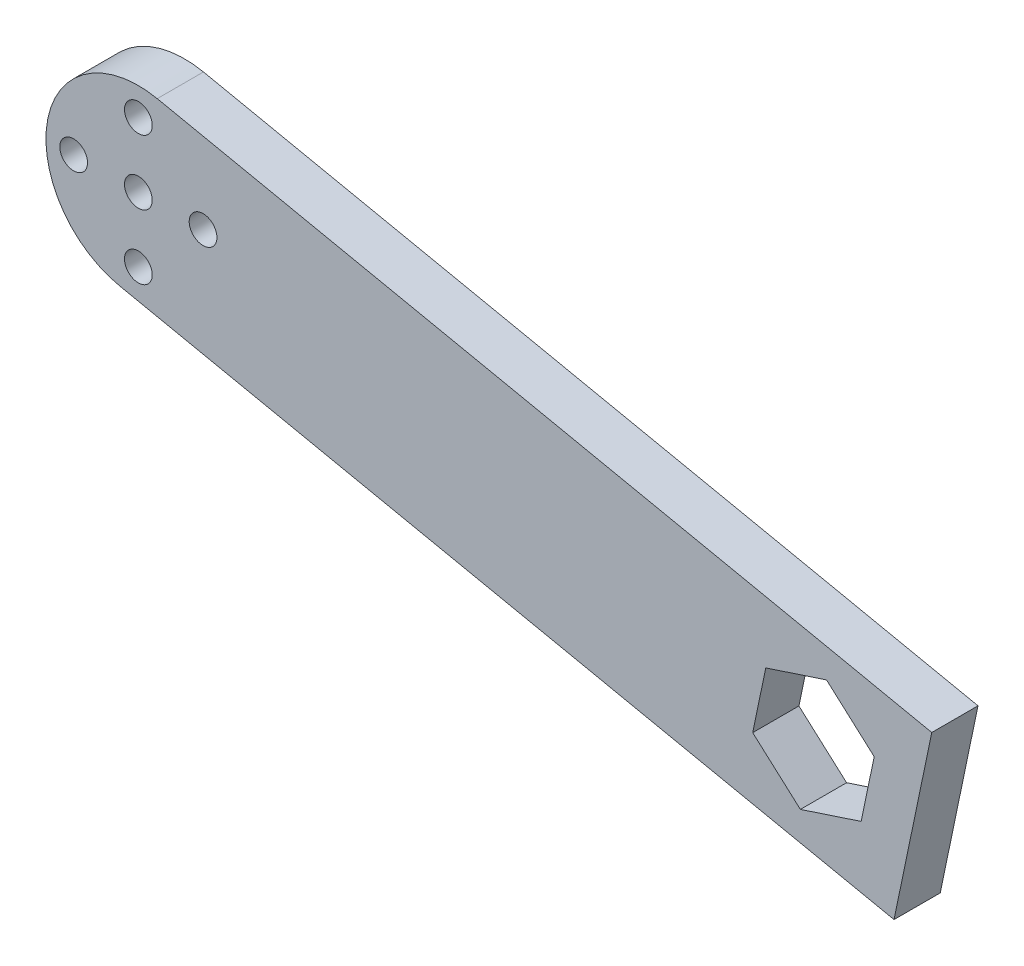
ISO-10303-21;
HEADER;
FILE_DESCRIPTION(('STEP AP214'),'2;1');
FILE_NAME('part.step','',(''),(''),'','','');
FILE_SCHEMA(('AUTOMOTIVE_DESIGN { 1 0 10303 214 1 1 1 1 }'));
ENDSEC;
DATA;
#1=APPLICATION_CONTEXT('core data for automotive mechanical design processes');
#2=APPLICATION_PROTOCOL_DEFINITION('international standard','automotive_design',2000,#1);
#3=PRODUCT_CONTEXT('',#1,'mechanical');
#4=PRODUCT('Part','Part','',(#3));
#5=PRODUCT_RELATED_PRODUCT_CATEGORY('part','',(#4));
#6=PRODUCT_DEFINITION_FORMATION('','',#4);
#7=PRODUCT_DEFINITION_CONTEXT('part definition',#1,'design');
#8=PRODUCT_DEFINITION('design','',#6,#7);
#9=PRODUCT_DEFINITION_SHAPE('','',#8);
#10=(LENGTH_UNIT() NAMED_UNIT(*) SI_UNIT(.MILLI.,.METRE.));
#11=(NAMED_UNIT(*) PLANE_ANGLE_UNIT() SI_UNIT($,.RADIAN.));
#12=(NAMED_UNIT(*) SI_UNIT($,.STERADIAN.) SOLID_ANGLE_UNIT());
#13=UNCERTAINTY_MEASURE_WITH_UNIT(LENGTH_MEASURE(1.E-05),#10,'distance_accuracy_value','');
#14=(GEOMETRIC_REPRESENTATION_CONTEXT(3) GLOBAL_UNCERTAINTY_ASSIGNED_CONTEXT((#13)) GLOBAL_UNIT_ASSIGNED_CONTEXT((#10,
#11,#12)) REPRESENTATION_CONTEXT('',''));
#15=CARTESIAN_POINT('',(0.,0.,0.));
#16=DIRECTION('',(0.,0.,1.));
#17=DIRECTION('',(1.,0.,0.));
#18=AXIS2_PLACEMENT_3D('',#15,#16,#17);
#19=CARTESIAN_POINT('',(0.,0.,5.));
#20=DIRECTION('',(0.,0.,1.));
#21=DIRECTION('',(1.,0.,0.));
#22=AXIS2_PLACEMENT_3D('',#19,#20,#21);
#23=PLANE('',#22);
#24=CARTESIAN_POINT('',(6.9999999999998,-1.99324781879028E-13,5.));
#25=DIRECTION('',(0.,0.,1.));
#26=DIRECTION('',(1.,0.,0.));
#27=AXIS2_PLACEMENT_3D('',#24,#25,#26);
#28=CIRCLE('',#27,1.50000000000032);
#29=CARTESIAN_POINT('',(8.50000000000012,-1.99324781879028E-13,5.));
#30=VERTEX_POINT('',#29);
#31=EDGE_CURVE('E169',#30,#30,#28,.T.);
#32=ORIENTED_EDGE('',*,*,#31,.F.);
#33=EDGE_LOOP('',(#32));
#34=FACE_BOUND('',#33,.T.);
#35=CARTESIAN_POINT('',(-3.96133615993348E-13,-7.,5.));
#36=DIRECTION('',(0.,0.,1.));
#37=DIRECTION('',(1.,0.,0.));
#38=AXIS2_PLACEMENT_3D('',#35,#36,#37);
#39=CIRCLE('',#38,1.50000000000042);
#40=CARTESIAN_POINT('',(1.50000000000003,-7.,5.));
#41=VERTEX_POINT('',#40);
#42=EDGE_CURVE('E181',#41,#41,#39,.T.);
#43=ORIENTED_EDGE('',*,*,#42,.F.);
#44=EDGE_LOOP('',(#43));
#45=FACE_BOUND('',#44,.T.);
#46=CARTESIAN_POINT('',(0.,0.,5.));
#47=DIRECTION('',(0.,0.,1.));
#48=DIRECTION('',(1.,0.,0.));
#49=AXIS2_PLACEMENT_3D('',#46,#47,#48);
#50=CIRCLE('',#49,10.);
#51=CARTESIAN_POINT('',(2.04300337109459,9.78908255280832,5.));
#52=VERTEX_POINT('',#51);
#53=CARTESIAN_POINT('',(-2.04300337109459,-9.78908255280831,5.));
#54=VERTEX_POINT('',#53);
#55=EDGE_CURVE('E193',#52,#54,#50,.T.);
#56=ORIENTED_EDGE('',*,*,#55,.T.);
#57=DIRECTION('',(0.978908255280831,-0.204300337109459,0.));
#58=VECTOR('',#57,1.);
#59=CARTESIAN_POINT('',(-2.04300337109459,-9.78908255280831,5.));
#60=LINE('',#59,#58);
#61=CARTESIAN_POINT('',(81.7605561816355,-27.2790724218626,5.));
#62=VERTEX_POINT('',#61);
#63=EDGE_CURVE('E196',#54,#62,#60,.T.);
#64=ORIENTED_EDGE('',*,*,#63,.T.);
#65=DIRECTION('',(0.204300337109459,0.978908255280831,0.));
#66=VECTOR('',#65,1.);
#67=CARTESIAN_POINT('',(85.8465629238247,-7.70090731624603,5.));
#68=LINE('',#67,#66);
#69=CARTESIAN_POINT('',(85.8465629238247,-7.70090731624603,5.));
#70=VERTEX_POINT('',#69);
#71=EDGE_CURVE('E199',#62,#70,#68,.T.);
#72=ORIENTED_EDGE('',*,*,#71,.T.);
#73=DIRECTION('',(-0.978908255280831,0.204300337109459,0.));
#74=VECTOR('',#73,1.);
#75=CARTESIAN_POINT('',(2.04300337109459,9.78908255280832,5.));
#76=LINE('',#75,#74);
#77=EDGE_CURVE('E201',#70,#52,#76,.T.);
#78=ORIENTED_EDGE('',*,*,#77,.T.);
#79=EDGE_LOOP('',(#56,#64,#72,#78));
#80=FACE_BOUND('',#79,.T.);
#81=CARTESIAN_POINT('',(0.,7.,5.));
#82=DIRECTION('',(0.,0.,1.));
#83=DIRECTION('',(1.,0.,0.));
#84=AXIS2_PLACEMENT_3D('',#81,#82,#83);
#85=CIRCLE('',#84,1.5);
#86=CARTESIAN_POINT('',(1.5,7.,5.));
#87=VERTEX_POINT('',#86);
#88=EDGE_CURVE('E187',#87,#87,#85,.T.);
#89=ORIENTED_EDGE('',*,*,#88,.F.);
#90=EDGE_LOOP('',(#89));
#91=FACE_BOUND('',#90,.T.);
#92=CARTESIAN_POINT('',(0.,0.,5.));
#93=DIRECTION('',(0.,0.,1.));
#94=DIRECTION('',(1.,0.,0.));
#95=AXIS2_PLACEMENT_3D('',#92,#93,#94);
#96=CIRCLE('',#95,1.5);
#97=CARTESIAN_POINT('',(1.5,0.,5.));
#98=VERTEX_POINT('',#97);
#99=EDGE_CURVE('E175',#98,#98,#96,.T.);
#100=ORIENTED_EDGE('',*,*,#99,.F.);
#101=EDGE_LOOP('',(#100));
#102=FACE_BOUND('',#101,.T.);
#103=CARTESIAN_POINT('',(-7.0000000000002,1.98162584836597E-13,5.));
#104=DIRECTION('',(0.,0.,1.));
#105=DIRECTION('',(1.,0.,0.));
#106=AXIS2_PLACEMENT_3D('',#103,#104,#105);
#107=CIRCLE('',#106,1.50000000000015);
#108=CARTESIAN_POINT('',(-5.50000000000004,1.98162584836597E-13,5.));
#109=VERTEX_POINT('',#108);
#110=EDGE_CURVE('E163',#109,#109,#107,.T.);
#111=ORIENTED_EDGE('',*,*,#110,.F.);
#112=EDGE_LOOP('',(#111));
#113=FACE_BOUND('',#112,.T.);
#114=DIRECTION('',(-0.949909585602232,-0.312524845701899,0.));
#115=VECTOR('',#114,1.);
#116=CARTESIAN_POINT('',(74.4562814431547,-8.47009242594916,5.));
#117=LINE('',#116,#115);
#118=CARTESIAN_POINT('',(74.4562814431547,-8.47009242594916,5.));
#119=VERTEX_POINT('',#118);
#120=CARTESIAN_POINT('',(67.8829071107872,-10.6327643582063,5.));
#121=VERTEX_POINT('',#120);
#122=EDGE_CURVE('E120',#119,#121,#117,.T.);
#123=ORIENTED_EDGE('',*,*,#122,.F.);
#124=DIRECTION('',(-0.745609248492772,0.666383409578933,0.));
#125=VECTOR('',#124,1.);
#126=CARTESIAN_POINT('',(79.6158974427247,-13.0814656202354,5.));
#127=LINE('',#126,#125);
#128=CARTESIAN_POINT('',(79.6158974427247,-13.0814656202354,5.));
#129=VERTEX_POINT('',#128);
#130=EDGE_CURVE('E112',#129,#119,#127,.T.);
#131=ORIENTED_EDGE('',*,*,#130,.F.);
#132=DIRECTION('',(0.20430033710946,0.978908255280831,0.));
#133=VECTOR('',#132,1.);
#134=CARTESIAN_POINT('',(78.2021391099272,-19.8555107467787,5.));
#135=LINE('',#134,#133);
#136=CARTESIAN_POINT('',(78.2021391099272,-19.8555107467787,5.));
#137=VERTEX_POINT('',#136);
#138=EDGE_CURVE('E141',#137,#129,#135,.T.);
#139=ORIENTED_EDGE('',*,*,#138,.F.);
#140=DIRECTION('',(0.949909585602232,0.3125248457019,0.));
#141=VECTOR('',#140,1.);
#142=CARTESIAN_POINT('',(71.6287647775598,-22.0181826790358,5.));
#143=LINE('',#142,#141);
#144=CARTESIAN_POINT('',(71.6287647775598,-22.0181826790358,5.));
#145=VERTEX_POINT('',#144);
#146=EDGE_CURVE('E139',#145,#137,#143,.T.);
#147=ORIENTED_EDGE('',*,*,#146,.F.);
#148=DIRECTION('',(0.745609248492774,-0.666383409578931,0.));
#149=VECTOR('',#148,1.);
#150=CARTESIAN_POINT('',(66.4691487779898,-17.4068094847496,5.));
#151=LINE('',#150,#149);
#152=CARTESIAN_POINT('',(66.4691487779898,-17.4068094847496,5.));
#153=VERTEX_POINT('',#152);
#154=EDGE_CURVE('E135',#153,#145,#151,.T.);
#155=ORIENTED_EDGE('',*,*,#154,.F.);
#156=DIRECTION('',(-0.204300337109457,-0.978908255280832,0.));
#157=VECTOR('',#156,1.);
#158=CARTESIAN_POINT('',(67.8829071107872,-10.6327643582063,5.));
#159=LINE('',#158,#157);
#160=EDGE_CURVE('E133',#121,#153,#159,.T.);
#161=ORIENTED_EDGE('',*,*,#160,.F.);
#162=EDGE_LOOP('',(#123,#131,#139,#147,#155,#161));
#163=FACE_BOUND('',#162,.T.);
#164=ADVANCED_FACE('F35',(#34,#45,#80,#91,#102,#113,#163),#23,.T.);
#165=CARTESIAN_POINT('',(0.,0.,0.));
#166=DIRECTION('',(0.,0.,1.));
#167=DIRECTION('',(1.,0.,0.));
#168=AXIS2_PLACEMENT_3D('',#165,#166,#167);
#169=PLANE('',#168);
#170=CARTESIAN_POINT('',(-7.0000000000002,1.98162584836597E-13,0.));
#171=DIRECTION('',(0.,0.,1.));
#172=DIRECTION('',(1.,0.,0.));
#173=AXIS2_PLACEMENT_3D('',#170,#171,#172);
#174=CIRCLE('',#173,1.50000000000015);
#175=CARTESIAN_POINT('',(-5.50000000000004,1.98162584836597E-13,0.));
#176=VERTEX_POINT('',#175);
#177=EDGE_CURVE('E128',#176,#176,#174,.T.);
#178=ORIENTED_EDGE('',*,*,#177,.T.);
#179=EDGE_LOOP('',(#178));
#180=FACE_BOUND('',#179,.T.);
#181=CARTESIAN_POINT('',(6.9999999999998,-1.99324781879028E-13,0.));
#182=DIRECTION('',(0.,0.,1.));
#183=DIRECTION('',(1.,0.,0.));
#184=AXIS2_PLACEMENT_3D('',#181,#182,#183);
#185=CIRCLE('',#184,1.50000000000032);
#186=CARTESIAN_POINT('',(8.50000000000012,-1.99324781879028E-13,0.));
#187=VERTEX_POINT('',#186);
#188=EDGE_CURVE('E166',#187,#187,#185,.T.);
#189=ORIENTED_EDGE('',*,*,#188,.T.);
#190=EDGE_LOOP('',(#189));
#191=FACE_BOUND('',#190,.T.);
#192=CARTESIAN_POINT('',(0.,0.,0.));
#193=DIRECTION('',(0.,0.,1.));
#194=DIRECTION('',(1.,0.,0.));
#195=AXIS2_PLACEMENT_3D('',#192,#193,#194);
#196=CIRCLE('',#195,1.5);
#197=CARTESIAN_POINT('',(1.5,0.,0.));
#198=VERTEX_POINT('',#197);
#199=EDGE_CURVE('E172',#198,#198,#196,.T.);
#200=ORIENTED_EDGE('',*,*,#199,.T.);
#201=EDGE_LOOP('',(#200));
#202=FACE_BOUND('',#201,.T.);
#203=CARTESIAN_POINT('',(-3.96133615993348E-13,-7.,0.));
#204=DIRECTION('',(0.,0.,1.));
#205=DIRECTION('',(1.,0.,0.));
#206=AXIS2_PLACEMENT_3D('',#203,#204,#205);
#207=CIRCLE('',#206,1.50000000000042);
#208=CARTESIAN_POINT('',(1.50000000000003,-7.,0.));
#209=VERTEX_POINT('',#208);
#210=EDGE_CURVE('E178',#209,#209,#207,.T.);
#211=ORIENTED_EDGE('',*,*,#210,.T.);
#212=EDGE_LOOP('',(#211));
#213=FACE_BOUND('',#212,.T.);
#214=CARTESIAN_POINT('',(0.,7.,0.));
#215=DIRECTION('',(0.,0.,1.));
#216=DIRECTION('',(1.,0.,0.));
#217=AXIS2_PLACEMENT_3D('',#214,#215,#216);
#218=CIRCLE('',#217,1.5);
#219=CARTESIAN_POINT('',(1.5,7.,0.));
#220=VERTEX_POINT('',#219);
#221=EDGE_CURVE('E184',#220,#220,#218,.T.);
#222=ORIENTED_EDGE('',*,*,#221,.T.);
#223=EDGE_LOOP('',(#222));
#224=FACE_BOUND('',#223,.T.);
#225=CARTESIAN_POINT('',(0.,0.,0.));
#226=DIRECTION('',(0.,0.,1.));
#227=DIRECTION('',(1.,0.,0.));
#228=AXIS2_PLACEMENT_3D('',#225,#226,#227);
#229=CIRCLE('',#228,10.);
#230=CARTESIAN_POINT('',(2.04300337109459,9.78908255280832,0.));
#231=VERTEX_POINT('',#230);
#232=CARTESIAN_POINT('',(-2.04300337109459,-9.78908255280831,0.));
#233=VERTEX_POINT('',#232);
#234=EDGE_CURVE('E190',#231,#233,#229,.T.);
#235=ORIENTED_EDGE('',*,*,#234,.F.);
#236=DIRECTION('',(-0.978908255280831,0.204300337109459,0.));
#237=VECTOR('',#236,1.);
#238=CARTESIAN_POINT('',(2.04300337109459,9.78908255280832,0.));
#239=LINE('',#238,#237);
#240=CARTESIAN_POINT('',(85.8465629238247,-7.70090731624603,0.));
#241=VERTEX_POINT('',#240);
#242=EDGE_CURVE('E197',#241,#231,#239,.T.);
#243=ORIENTED_EDGE('',*,*,#242,.F.);
#244=DIRECTION('',(0.204300337109459,0.978908255280831,0.));
#245=VECTOR('',#244,1.);
#246=CARTESIAN_POINT('',(85.8465629238247,-7.70090731624603,0.));
#247=LINE('',#246,#245);
#248=CARTESIAN_POINT('',(81.7605561816355,-27.2790724218626,0.));
#249=VERTEX_POINT('',#248);
#250=EDGE_CURVE('E208',#249,#241,#247,.T.);
#251=ORIENTED_EDGE('',*,*,#250,.F.);
#252=DIRECTION('',(0.978908255280831,-0.204300337109459,0.));
#253=VECTOR('',#252,1.);
#254=CARTESIAN_POINT('',(-2.04300337109459,-9.78908255280831,0.));
#255=LINE('',#254,#253);
#256=EDGE_CURVE('E206',#233,#249,#255,.T.);
#257=ORIENTED_EDGE('',*,*,#256,.F.);
#258=EDGE_LOOP('',(#235,#243,#251,#257));
#259=FACE_BOUND('',#258,.T.);
#260=DIRECTION('',(-0.745609248492772,0.666383409578933,0.));
#261=VECTOR('',#260,1.);
#262=CARTESIAN_POINT('',(79.6158974427247,-13.0814656202354,0.));
#263=LINE('',#262,#261);
#264=CARTESIAN_POINT('',(79.6158974427246,-13.0814656202354,0.));
#265=VERTEX_POINT('',#264);
#266=CARTESIAN_POINT('',(74.4562814431547,-8.47009242594916,0.));
#267=VERTEX_POINT('',#266);
#268=EDGE_CURVE('E58',#265,#267,#263,.T.);
#269=ORIENTED_EDGE('',*,*,#268,.T.);
#270=DIRECTION('',(-0.949909585602232,-0.312524845701899,0.));
#271=VECTOR('',#270,1.);
#272=CARTESIAN_POINT('',(74.4562814431547,-8.47009242594916,0.));
#273=LINE('',#272,#271);
#274=CARTESIAN_POINT('',(67.8829071107872,-10.6327643582063,0.));
#275=VERTEX_POINT('',#274);
#276=EDGE_CURVE('E127',#267,#275,#273,.T.);
#277=ORIENTED_EDGE('',*,*,#276,.T.);
#278=DIRECTION('',(-0.204300337109457,-0.978908255280832,0.));
#279=VECTOR('',#278,1.);
#280=CARTESIAN_POINT('',(67.8829071107872,-10.6327643582063,0.));
#281=LINE('',#280,#279);
#282=CARTESIAN_POINT('',(66.4691487779898,-17.4068094847496,0.));
#283=VERTEX_POINT('',#282);
#284=EDGE_CURVE('E145',#275,#283,#281,.T.);
#285=ORIENTED_EDGE('',*,*,#284,.T.);
#286=DIRECTION('',(0.745609248492774,-0.666383409578931,0.));
#287=VECTOR('',#286,1.);
#288=CARTESIAN_POINT('',(66.4691487779898,-17.4068094847496,0.));
#289=LINE('',#288,#287);
#290=CARTESIAN_POINT('',(71.6287647775598,-22.0181826790358,0.));
#291=VERTEX_POINT('',#290);
#292=EDGE_CURVE('E148',#283,#291,#289,.T.);
#293=ORIENTED_EDGE('',*,*,#292,.T.);
#294=DIRECTION('',(0.949909585602232,0.3125248457019,0.));
#295=VECTOR('',#294,1.);
#296=CARTESIAN_POINT('',(71.6287647775598,-22.0181826790358,0.));
#297=LINE('',#296,#295);
#298=CARTESIAN_POINT('',(78.2021391099272,-19.8555107467787,0.));
#299=VERTEX_POINT('',#298);
#300=EDGE_CURVE('E151',#291,#299,#297,.T.);
#301=ORIENTED_EDGE('',*,*,#300,.T.);
#302=DIRECTION('',(0.20430033710946,0.978908255280831,0.));
#303=VECTOR('',#302,1.);
#304=CARTESIAN_POINT('',(78.2021391099272,-19.8555107467787,0.));
#305=LINE('',#304,#303);
#306=EDGE_CURVE('E121',#299,#265,#305,.T.);
#307=ORIENTED_EDGE('',*,*,#306,.T.);
#308=EDGE_LOOP('',(#269,#277,#285,#293,#301,#307));
#309=FACE_BOUND('',#308,.T.);
#310=ADVANCED_FACE('F226',(#180,#191,#202,#213,#224,#259,#309),#169,.F.);
#311=CARTESIAN_POINT('',(0.,0.,5.));
#312=DIRECTION('',(0.,0.,-1.));
#313=DIRECTION('',(-1.,0.,0.));
#314=AXIS2_PLACEMENT_3D('',#311,#312,#313);
#315=CYLINDRICAL_SURFACE('',#314,10.);
#316=ORIENTED_EDGE('',*,*,#234,.T.);
#317=DIRECTION('',(0.,0.,-1.));
#318=VECTOR('',#317,1.);
#319=CARTESIAN_POINT('',(-2.04300337109459,-9.78908255280831,5.));
#320=LINE('',#319,#318);
#321=EDGE_CURVE('E11',#54,#233,#320,.T.);
#322=ORIENTED_EDGE('',*,*,#321,.F.);
#323=ORIENTED_EDGE('',*,*,#55,.F.);
#324=DIRECTION('',(0.,0.,-1.));
#325=VECTOR('',#324,1.);
#326=CARTESIAN_POINT('',(2.04300337109459,9.78908255280832,5.));
#327=LINE('',#326,#325);
#328=EDGE_CURVE('E203',#52,#231,#327,.T.);
#329=ORIENTED_EDGE('',*,*,#328,.T.);
#330=EDGE_LOOP('',(#316,#322,#323,#329));
#331=FACE_BOUND('',#330,.T.);
#332=ADVANCED_FACE('F37',(#331),#315,.T.);
#333=CARTESIAN_POINT('',(-2.04300337109459,-9.78908255280831,5.));
#334=DIRECTION('',(0.204300337109459,0.978908255280831,0.));
#335=DIRECTION('',(-0.978908255280831,0.204300337109459,0.));
#336=AXIS2_PLACEMENT_3D('',#333,#334,#335);
#337=PLANE('',#336);
#338=ORIENTED_EDGE('',*,*,#256,.T.);
#339=DIRECTION('',(0.,0.,-1.));
#340=VECTOR('',#339,1.);
#341=CARTESIAN_POINT('',(81.7605561816355,-27.2790724218626,5.));
#342=LINE('',#341,#340);
#343=EDGE_CURVE('E43',#62,#249,#342,.T.);
#344=ORIENTED_EDGE('',*,*,#343,.F.);
#345=ORIENTED_EDGE('',*,*,#63,.F.);
#346=ORIENTED_EDGE('',*,*,#321,.T.);
#347=EDGE_LOOP('',(#338,#344,#345,#346));
#348=FACE_BOUND('',#347,.T.);
#349=ADVANCED_FACE('F237',(#348),#337,.F.);
#350=CARTESIAN_POINT('',(85.8465629238247,-7.70090731624603,5.));
#351=DIRECTION('',(-0.978908255280831,0.204300337109459,0.));
#352=DIRECTION('',(-0.204300337109459,-0.978908255280831,0.));
#353=AXIS2_PLACEMENT_3D('',#350,#351,#352);
#354=PLANE('',#353);
#355=ORIENTED_EDGE('',*,*,#250,.T.);
#356=DIRECTION('',(0.,0.,-1.));
#357=VECTOR('',#356,1.);
#358=CARTESIAN_POINT('',(85.8465629238247,-7.70090731624603,5.));
#359=LINE('',#358,#357);
#360=EDGE_CURVE('E213',#70,#241,#359,.T.);
#361=ORIENTED_EDGE('',*,*,#360,.F.);
#362=ORIENTED_EDGE('',*,*,#71,.F.);
#363=ORIENTED_EDGE('',*,*,#343,.T.);
#364=EDGE_LOOP('',(#355,#361,#362,#363));
#365=FACE_BOUND('',#364,.T.);
#366=ADVANCED_FACE('F220',(#365),#354,.F.);
#367=CARTESIAN_POINT('',(2.04300337109459,9.78908255280832,5.));
#368=DIRECTION('',(-0.204300337109459,-0.978908255280831,0.));
#369=DIRECTION('',(0.978908255280831,-0.204300337109459,0.));
#370=AXIS2_PLACEMENT_3D('',#367,#368,#369);
#371=PLANE('',#370);
#372=ORIENTED_EDGE('',*,*,#242,.T.);
#373=ORIENTED_EDGE('',*,*,#328,.F.);
#374=ORIENTED_EDGE('',*,*,#77,.F.);
#375=ORIENTED_EDGE('',*,*,#360,.T.);
#376=EDGE_LOOP('',(#372,#373,#374,#375));
#377=FACE_BOUND('',#376,.T.);
#378=ADVANCED_FACE('F230',(#377),#371,.F.);
#379=CARTESIAN_POINT('',(0.,7.,5.));
#380=DIRECTION('',(0.,0.,-1.));
#381=DIRECTION('',(-1.,0.,0.));
#382=AXIS2_PLACEMENT_3D('',#379,#380,#381);
#383=CYLINDRICAL_SURFACE('',#382,1.5);
#384=ORIENTED_EDGE('',*,*,#88,.T.);
#385=EDGE_LOOP('',(#384));
#386=FACE_BOUND('',#385,.T.);
#387=ORIENTED_EDGE('',*,*,#221,.F.);
#388=EDGE_LOOP('',(#387));
#389=FACE_BOUND('',#388,.T.);
#390=ADVANCED_FACE('F255',(#386,#389),#383,.F.);
#391=CARTESIAN_POINT('',(-3.96133615993348E-13,-7.,5.));
#392=DIRECTION('',(0.,0.,-1.));
#393=DIRECTION('',(-1.,0.,0.));
#394=AXIS2_PLACEMENT_3D('',#391,#392,#393);
#395=CYLINDRICAL_SURFACE('',#394,1.50000000000042);
#396=ORIENTED_EDGE('',*,*,#42,.T.);
#397=EDGE_LOOP('',(#396));
#398=FACE_BOUND('',#397,.T.);
#399=ORIENTED_EDGE('',*,*,#210,.F.);
#400=EDGE_LOOP('',(#399));
#401=FACE_BOUND('',#400,.T.);
#402=ADVANCED_FACE('F262',(#398,#401),#395,.F.);
#403=CARTESIAN_POINT('',(0.,0.,5.));
#404=DIRECTION('',(0.,0.,-1.));
#405=DIRECTION('',(-1.,0.,0.));
#406=AXIS2_PLACEMENT_3D('',#403,#404,#405);
#407=CYLINDRICAL_SURFACE('',#406,1.5);
#408=ORIENTED_EDGE('',*,*,#99,.T.);
#409=EDGE_LOOP('',(#408));
#410=FACE_BOUND('',#409,.T.);
#411=ORIENTED_EDGE('',*,*,#199,.F.);
#412=EDGE_LOOP('',(#411));
#413=FACE_BOUND('',#412,.T.);
#414=ADVANCED_FACE('F267',(#410,#413),#407,.F.);
#415=CARTESIAN_POINT('',(6.9999999999998,-1.99324781879028E-13,5.));
#416=DIRECTION('',(0.,0.,-1.));
#417=DIRECTION('',(-1.,0.,0.));
#418=AXIS2_PLACEMENT_3D('',#415,#416,#417);
#419=CYLINDRICAL_SURFACE('',#418,1.50000000000032);
#420=ORIENTED_EDGE('',*,*,#31,.T.);
#421=EDGE_LOOP('',(#420));
#422=FACE_BOUND('',#421,.T.);
#423=ORIENTED_EDGE('',*,*,#188,.F.);
#424=EDGE_LOOP('',(#423));
#425=FACE_BOUND('',#424,.T.);
#426=ADVANCED_FACE('F281',(#422,#425),#419,.F.);
#427=CARTESIAN_POINT('',(-7.0000000000002,1.98162584836597E-13,5.));
#428=DIRECTION('',(0.,0.,-1.));
#429=DIRECTION('',(-1.,0.,0.));
#430=AXIS2_PLACEMENT_3D('',#427,#428,#429);
#431=CYLINDRICAL_SURFACE('',#430,1.50000000000015);
#432=ORIENTED_EDGE('',*,*,#110,.T.);
#433=EDGE_LOOP('',(#432));
#434=FACE_BOUND('',#433,.T.);
#435=ORIENTED_EDGE('',*,*,#177,.F.);
#436=EDGE_LOOP('',(#435));
#437=FACE_BOUND('',#436,.T.);
#438=ADVANCED_FACE('F278',(#434,#437),#431,.F.);
#439=CARTESIAN_POINT('',(79.6158974427247,-13.0814656202354,5.));
#440=DIRECTION('',(-0.666383409578933,-0.745609248492772,0.));
#441=DIRECTION('',(0.745609248492772,-0.666383409578933,0.));
#442=AXIS2_PLACEMENT_3D('',#439,#440,#441);
#443=PLANE('',#442);
#444=ORIENTED_EDGE('',*,*,#268,.F.);
#445=DIRECTION('',(0.,0.,-1.));
#446=VECTOR('',#445,1.);
#447=CARTESIAN_POINT('',(79.6158974427247,-13.0814656202354,5.));
#448=LINE('',#447,#446);
#449=EDGE_CURVE('E116',#129,#265,#448,.T.);
#450=ORIENTED_EDGE('',*,*,#449,.F.);
#451=ORIENTED_EDGE('',*,*,#130,.T.);
#452=DIRECTION('',(0.,0.,-1.));
#453=VECTOR('',#452,1.);
#454=CARTESIAN_POINT('',(74.4562814431547,-8.47009242594916,5.));
#455=LINE('',#454,#453);
#456=EDGE_CURVE('E115',#119,#267,#455,.T.);
#457=ORIENTED_EDGE('',*,*,#456,.T.);
#458=EDGE_LOOP('',(#444,#450,#451,#457));
#459=FACE_BOUND('',#458,.T.);
#460=ADVANCED_FACE('F114',(#459),#443,.T.);
#461=CARTESIAN_POINT('',(74.4562814431547,-8.47009242594916,5.));
#462=DIRECTION('',(0.312524845701899,-0.949909585602232,0.));
#463=DIRECTION('',(0.949909585602232,0.312524845701899,0.));
#464=AXIS2_PLACEMENT_3D('',#461,#462,#463);
#465=PLANE('',#464);
#466=ORIENTED_EDGE('',*,*,#276,.F.);
#467=ORIENTED_EDGE('',*,*,#456,.F.);
#468=ORIENTED_EDGE('',*,*,#122,.T.);
#469=DIRECTION('',(0.,0.,-1.));
#470=VECTOR('',#469,1.);
#471=CARTESIAN_POINT('',(67.8829071107872,-10.6327643582063,5.));
#472=LINE('',#471,#470);
#473=EDGE_CURVE('E129',#121,#275,#472,.T.);
#474=ORIENTED_EDGE('',*,*,#473,.T.);
#475=EDGE_LOOP('',(#466,#467,#468,#474));
#476=FACE_BOUND('',#475,.T.);
#477=ADVANCED_FACE('F124',(#476),#465,.T.);
#478=CARTESIAN_POINT('',(67.8829071107872,-10.6327643582063,5.));
#479=DIRECTION('',(0.978908255280832,-0.204300337109457,0.));
#480=DIRECTION('',(0.204300337109458,0.978908255280832,0.));
#481=AXIS2_PLACEMENT_3D('',#478,#479,#480);
#482=PLANE('',#481);
#483=ORIENTED_EDGE('',*,*,#284,.F.);
#484=ORIENTED_EDGE('',*,*,#473,.F.);
#485=ORIENTED_EDGE('',*,*,#160,.T.);
#486=DIRECTION('',(0.,0.,-1.));
#487=VECTOR('',#486,1.);
#488=CARTESIAN_POINT('',(66.4691487779898,-17.4068094847496,5.));
#489=LINE('',#488,#487);
#490=EDGE_CURVE('E160',#153,#283,#489,.T.);
#491=ORIENTED_EDGE('',*,*,#490,.T.);
#492=EDGE_LOOP('',(#483,#484,#485,#491));
#493=FACE_BOUND('',#492,.T.);
#494=ADVANCED_FACE('F305',(#493),#482,.T.);
#495=CARTESIAN_POINT('',(66.4691487779898,-17.4068094847496,5.));
#496=DIRECTION('',(0.666383409578931,0.745609248492774,0.));
#497=DIRECTION('',(-0.745609248492774,0.666383409578931,0.));
#498=AXIS2_PLACEMENT_3D('',#495,#496,#497);
#499=PLANE('',#498);
#500=ORIENTED_EDGE('',*,*,#292,.F.);
#501=ORIENTED_EDGE('',*,*,#490,.F.);
#502=ORIENTED_EDGE('',*,*,#154,.T.);
#503=DIRECTION('',(0.,0.,-1.));
#504=VECTOR('',#503,1.);
#505=CARTESIAN_POINT('',(71.6287647775598,-22.0181826790358,5.));
#506=LINE('',#505,#504);
#507=EDGE_CURVE('E158',#145,#291,#506,.T.);
#508=ORIENTED_EDGE('',*,*,#507,.T.);
#509=EDGE_LOOP('',(#500,#501,#502,#508));
#510=FACE_BOUND('',#509,.T.);
#511=ADVANCED_FACE('F308',(#510),#499,.T.);
#512=CARTESIAN_POINT('',(71.6287647775598,-22.0181826790358,5.));
#513=DIRECTION('',(-0.3125248457019,0.949909585602232,0.));
#514=DIRECTION('',(-0.949909585602232,-0.3125248457019,0.));
#515=AXIS2_PLACEMENT_3D('',#512,#513,#514);
#516=PLANE('',#515);
#517=ORIENTED_EDGE('',*,*,#300,.F.);
#518=ORIENTED_EDGE('',*,*,#507,.F.);
#519=ORIENTED_EDGE('',*,*,#146,.T.);
#520=DIRECTION('',(0.,0.,-1.));
#521=VECTOR('',#520,1.);
#522=CARTESIAN_POINT('',(78.2021391099272,-19.8555107467787,5.));
#523=LINE('',#522,#521);
#524=EDGE_CURVE('E50',#137,#299,#523,.T.);
#525=ORIENTED_EDGE('',*,*,#524,.T.);
#526=EDGE_LOOP('',(#517,#518,#519,#525));
#527=FACE_BOUND('',#526,.T.);
#528=ADVANCED_FACE('F312',(#527),#516,.T.);
#529=CARTESIAN_POINT('',(78.2021391099272,-19.8555107467787,5.));
#530=DIRECTION('',(-0.978908255280831,0.20430033710946,0.));
#531=DIRECTION('',(-0.20430033710946,-0.978908255280831,0.));
#532=AXIS2_PLACEMENT_3D('',#529,#530,#531);
#533=PLANE('',#532);
#534=ORIENTED_EDGE('',*,*,#306,.F.);
#535=ORIENTED_EDGE('',*,*,#524,.F.);
#536=ORIENTED_EDGE('',*,*,#138,.T.);
#537=ORIENTED_EDGE('',*,*,#449,.T.);
#538=EDGE_LOOP('',(#534,#535,#536,#537));
#539=FACE_BOUND('',#538,.T.);
#540=ADVANCED_FACE('F316',(#539),#533,.T.);
#541=CLOSED_SHELL('',(#164,#310,#332,#349,#366,#378,#390,#402,#414,#426,#438,#460,#477,#494,
#511,#528,#540));
#542=MANIFOLD_SOLID_BREP('B2',#541);
#543=ADVANCED_BREP_SHAPE_REPRESENTATION('',(#18,#542),#14);
#544=SHAPE_DEFINITION_REPRESENTATION(#9,#543);
ENDSEC;
END-ISO-10303-21;
